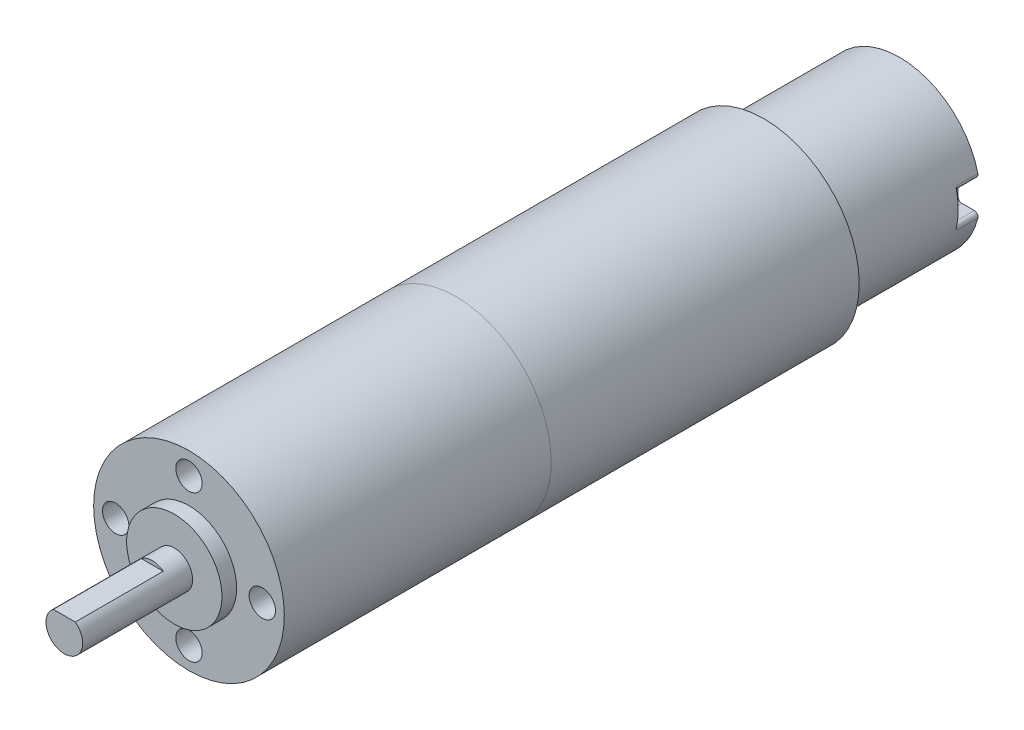
ISO-10303-21;
HEADER;
FILE_DESCRIPTION(('STEP AP214'),'2;1');
FILE_NAME('part.step','',(''),(''),'','','');
FILE_SCHEMA(('AUTOMOTIVE_DESIGN { 1 0 10303 214 1 1 1 1 }'));
ENDSEC;
DATA;
#1=APPLICATION_CONTEXT('core data for automotive mechanical design processes');
#2=APPLICATION_PROTOCOL_DEFINITION('international standard','automotive_design',2000,#1);
#3=PRODUCT_CONTEXT('',#1,'mechanical');
#4=PRODUCT('Part','Part','',(#3));
#5=PRODUCT_RELATED_PRODUCT_CATEGORY('part','',(#4));
#6=PRODUCT_DEFINITION_FORMATION('','',#4);
#7=PRODUCT_DEFINITION_CONTEXT('part definition',#1,'design');
#8=PRODUCT_DEFINITION('design','',#6,#7);
#9=PRODUCT_DEFINITION_SHAPE('','',#8);
#10=(LENGTH_UNIT() NAMED_UNIT(*) SI_UNIT(.MILLI.,.METRE.));
#11=(NAMED_UNIT(*) PLANE_ANGLE_UNIT() SI_UNIT($,.RADIAN.));
#12=(NAMED_UNIT(*) SI_UNIT($,.STERADIAN.) SOLID_ANGLE_UNIT());
#13=UNCERTAINTY_MEASURE_WITH_UNIT(LENGTH_MEASURE(1.E-05),#10,'distance_accuracy_value','');
#14=(GEOMETRIC_REPRESENTATION_CONTEXT(3) GLOBAL_UNCERTAINTY_ASSIGNED_CONTEXT((#13)) GLOBAL_UNIT_ASSIGNED_CONTEXT((#10,
#11,#12)) REPRESENTATION_CONTEXT('',''));
#15=CARTESIAN_POINT('',(0.,0.,0.));
#16=DIRECTION('',(0.,0.,1.));
#17=DIRECTION('',(1.,0.,0.));
#18=AXIS2_PLACEMENT_3D('',#15,#16,#17);
#19=CARTESIAN_POINT('',(0.,0.,-60.5));
#20=DIRECTION('',(0.,0.,1.));
#21=DIRECTION('',(1.,0.,0.));
#22=AXIS2_PLACEMENT_3D('',#19,#20,#21);
#23=CYLINDRICAL_SURFACE('',#22,11.);
#24=CARTESIAN_POINT('',(0.,0.,-56.5));
#25=DIRECTION('',(0.,0.,-1.));
#26=DIRECTION('',(-1.,0.,0.));
#27=AXIS2_PLACEMENT_3D('',#24,#25,#26);
#28=CIRCLE('',#27,11.);
#29=CARTESIAN_POINT('',(7.69839633446142,-7.85714285714285,-56.5));
#30=VERTEX_POINT('',#29);
#31=CARTESIAN_POINT('',(-7.69839633446141,-7.85714285714286,-56.5));
#32=VERTEX_POINT('',#31);
#33=EDGE_CURVE('E311',#30,#32,#28,.T.);
#34=ORIENTED_EDGE('',*,*,#33,.F.);
#35=DIRECTION('',(0.,0.,1.));
#36=VECTOR('',#35,1.);
#37=CARTESIAN_POINT('',(7.69839633446142,-7.85714285714285,-60.5));
#38=LINE('',#37,#36);
#39=CARTESIAN_POINT('',(7.69839633446142,-7.85714285714285,-60.5));
#40=VERTEX_POINT('',#39);
#41=EDGE_CURVE('E214',#30,#40,#38,.F.);
#42=ORIENTED_EDGE('',*,*,#41,.T.);
#43=CARTESIAN_POINT('',(0.,0.,-60.5));
#44=DIRECTION('',(0.,0.,-1.));
#45=DIRECTION('',(-1.,0.,0.));
#46=AXIS2_PLACEMENT_3D('',#43,#44,#45);
#47=CIRCLE('',#46,11.);
#48=CARTESIAN_POINT('',(10.683659933242,-2.61904761904762,-60.5));
#49=VERTEX_POINT('',#48);
#50=EDGE_CURVE('E211',#49,#40,#47,.T.);
#51=ORIENTED_EDGE('',*,*,#50,.F.);
#52=DIRECTION('',(0.,0.,1.));
#53=VECTOR('',#52,1.);
#54=CARTESIAN_POINT('',(10.683659933242,-2.61904761904762,-60.5));
#55=LINE('',#54,#53);
#56=CARTESIAN_POINT('',(10.683659933242,-2.61904761904762,-57.5));
#57=VERTEX_POINT('',#56);
#58=EDGE_CURVE('E307',#49,#57,#55,.T.);
#59=ORIENTED_EDGE('',*,*,#58,.T.);
#60=CARTESIAN_POINT('',(0.,0.,-57.5));
#61=DIRECTION('',(0.,0.,-1.));
#62=DIRECTION('',(-1.,0.,0.));
#63=AXIS2_PLACEMENT_3D('',#60,#61,#62);
#64=CIRCLE('',#63,11.);
#65=CARTESIAN_POINT('',(10.683659933242,2.61904761904762,-57.5));
#66=VERTEX_POINT('',#65);
#67=EDGE_CURVE('E293',#66,#57,#64,.T.);
#68=ORIENTED_EDGE('',*,*,#67,.F.);
#69=DIRECTION('',(0.,0.,1.));
#70=VECTOR('',#69,1.);
#71=CARTESIAN_POINT('',(10.683659933242,2.61904761904762,-60.5));
#72=LINE('',#71,#70);
#73=CARTESIAN_POINT('',(10.683659933242,2.61904761904762,-60.5));
#74=VERTEX_POINT('',#73);
#75=EDGE_CURVE('E320',#66,#74,#72,.F.);
#76=ORIENTED_EDGE('',*,*,#75,.T.);
#77=CARTESIAN_POINT('',(-10.683659933242,2.61904761904762,-60.5));
#78=VERTEX_POINT('',#77);
#79=EDGE_CURVE('E209',#78,#74,#47,.T.);
#80=ORIENTED_EDGE('',*,*,#79,.F.);
#81=DIRECTION('',(0.,0.,1.));
#82=VECTOR('',#81,1.);
#83=CARTESIAN_POINT('',(-10.683659933242,2.61904761904762,-60.5));
#84=LINE('',#83,#82);
#85=CARTESIAN_POINT('',(-10.683659933242,2.61904761904762,-57.5));
#86=VERTEX_POINT('',#85);
#87=EDGE_CURVE('E215',#78,#86,#84,.T.);
#88=ORIENTED_EDGE('',*,*,#87,.T.);
#89=CARTESIAN_POINT('',(0.,0.,-57.5));
#90=DIRECTION('',(0.,0.,1.));
#91=DIRECTION('',(1.,0.,0.));
#92=AXIS2_PLACEMENT_3D('',#89,#90,#91);
#93=CIRCLE('',#92,11.);
#94=CARTESIAN_POINT('',(-10.683659933242,-2.61904761904762,-57.5));
#95=VERTEX_POINT('',#94);
#96=EDGE_CURVE('E350',#86,#95,#93,.T.);
#97=ORIENTED_EDGE('',*,*,#96,.T.);
#98=DIRECTION('',(0.,0.,1.));
#99=VECTOR('',#98,1.);
#100=CARTESIAN_POINT('',(-10.683659933242,-2.61904761904762,-60.5));
#101=LINE('',#100,#99);
#102=CARTESIAN_POINT('',(-10.683659933242,-2.61904761904762,-60.5));
#103=VERTEX_POINT('',#102);
#104=EDGE_CURVE('E207',#95,#103,#101,.F.);
#105=ORIENTED_EDGE('',*,*,#104,.T.);
#106=CARTESIAN_POINT('',(-7.69839633446141,-7.85714285714286,-60.5));
#107=VERTEX_POINT('',#106);
#108=EDGE_CURVE('E190',#107,#103,#47,.T.);
#109=ORIENTED_EDGE('',*,*,#108,.F.);
#110=DIRECTION('',(0.,0.,1.));
#111=VECTOR('',#110,1.);
#112=CARTESIAN_POINT('',(-7.69839633446141,-7.85714285714286,-60.5));
#113=LINE('',#112,#111);
#114=EDGE_CURVE('E204',#107,#32,#113,.T.);
#115=ORIENTED_EDGE('',*,*,#114,.T.);
#116=EDGE_LOOP('',(#34,#42,#51,#59,#68,#76,#80,#88,#97,#105,#109,#115));
#117=FACE_BOUND('',#116,.T.);
#118=CARTESIAN_POINT('',(0.,0.,-42.));
#119=DIRECTION('',(0.,0.,-1.));
#120=DIRECTION('',(-1.,0.,0.));
#121=AXIS2_PLACEMENT_3D('',#118,#119,#120);
#122=CIRCLE('',#121,11.);
#123=CARTESIAN_POINT('',(-11.,0.,-42.));
#124=VERTEX_POINT('',#123);
#125=EDGE_CURVE('E317',#124,#124,#122,.T.);
#126=ORIENTED_EDGE('',*,*,#125,.T.);
#127=EDGE_LOOP('',(#126));
#128=FACE_BOUND('',#127,.T.);
#129=ADVANCED_FACE('F47',(#117,#128),#23,.T.);
#130=CARTESIAN_POINT('',(0.,0.,-60.5));
#131=DIRECTION('',(0.,0.,-1.));
#132=DIRECTION('',(-1.,0.,0.));
#133=AXIS2_PLACEMENT_3D('',#130,#131,#132);
#134=PLANE('',#133);
#135=ORIENTED_EDGE('',*,*,#50,.T.);
#136=CARTESIAN_POINT('',(7.34846922834954,-7.5,-60.5));
#137=DIRECTION('',(0.,0.,-1.));
#138=DIRECTION('',(-1.,0.,0.));
#139=AXIS2_PLACEMENT_3D('',#136,#137,#138);
#140=CIRCLE('',#139,0.5);
#141=CARTESIAN_POINT('',(7.34846922834954,-8.,-60.5));
#142=VERTEX_POINT('',#141);
#143=EDGE_CURVE('E197',#40,#142,#140,.T.);
#144=ORIENTED_EDGE('',*,*,#143,.T.);
#145=DIRECTION('',(-1.,0.,0.));
#146=VECTOR('',#145,1.);
#147=CARTESIAN_POINT('',(0.,-8.,-60.5));
#148=LINE('',#147,#146);
#149=CARTESIAN_POINT('',(-7.34846922834953,-8.,-60.5));
#150=VERTEX_POINT('',#149);
#151=EDGE_CURVE('E192',#142,#150,#148,.T.);
#152=ORIENTED_EDGE('',*,*,#151,.T.);
#153=CARTESIAN_POINT('',(-7.34846922834953,-7.5,-60.5));
#154=DIRECTION('',(0.,0.,-1.));
#155=DIRECTION('',(-1.,0.,0.));
#156=AXIS2_PLACEMENT_3D('',#153,#154,#155);
#157=CIRCLE('',#156,0.5);
#158=EDGE_CURVE('E186',#150,#107,#157,.T.);
#159=ORIENTED_EDGE('',*,*,#158,.T.);
#160=ORIENTED_EDGE('',*,*,#108,.T.);
#161=CARTESIAN_POINT('',(-10.1980390271856,-2.5,-60.5));
#162=DIRECTION('',(0.,0.,-1.));
#163=DIRECTION('',(-1.,0.,0.));
#164=AXIS2_PLACEMENT_3D('',#161,#162,#163);
#165=CIRCLE('',#164,0.5);
#166=CARTESIAN_POINT('',(-10.1980390271856,-2.,-60.5));
#167=VERTEX_POINT('',#166);
#168=EDGE_CURVE('E227',#103,#167,#165,.T.);
#169=ORIENTED_EDGE('',*,*,#168,.T.);
#170=DIRECTION('',(-1.,0.,0.));
#171=VECTOR('',#170,1.);
#172=CARTESIAN_POINT('',(0.,-2.,-60.5));
#173=LINE('',#172,#171);
#174=CARTESIAN_POINT('',(-8.5,-2.,-60.5));
#175=VERTEX_POINT('',#174);
#176=EDGE_CURVE('E358',#175,#167,#173,.T.);
#177=ORIENTED_EDGE('',*,*,#176,.F.);
#178=CARTESIAN_POINT('',(-8.5,-1.5,-60.5));
#179=DIRECTION('',(0.,0.,-1.));
#180=DIRECTION('',(-1.,0.,0.));
#181=AXIS2_PLACEMENT_3D('',#178,#179,#180);
#182=CIRCLE('',#181,0.5);
#183=CARTESIAN_POINT('',(-8.,-1.5,-60.5));
#184=VERTEX_POINT('',#183);
#185=EDGE_CURVE('E282',#175,#184,#182,.F.);
#186=ORIENTED_EDGE('',*,*,#185,.T.);
#187=DIRECTION('',(0.,-1.,0.));
#188=VECTOR('',#187,1.);
#189=CARTESIAN_POINT('',(-8.,0.,-60.5));
#190=LINE('',#189,#188);
#191=CARTESIAN_POINT('',(-8.,1.5,-60.5));
#192=VERTEX_POINT('',#191);
#193=EDGE_CURVE('E362',#192,#184,#190,.T.);
#194=ORIENTED_EDGE('',*,*,#193,.F.);
#195=CARTESIAN_POINT('',(-8.5,1.5,-60.5));
#196=DIRECTION('',(0.,0.,-1.));
#197=DIRECTION('',(-1.,0.,0.));
#198=AXIS2_PLACEMENT_3D('',#195,#196,#197);
#199=CIRCLE('',#198,0.5);
#200=CARTESIAN_POINT('',(-8.5,2.,-60.5));
#201=VERTEX_POINT('',#200);
#202=EDGE_CURVE('E280',#192,#201,#199,.F.);
#203=ORIENTED_EDGE('',*,*,#202,.T.);
#204=DIRECTION('',(-1.,0.,0.));
#205=VECTOR('',#204,1.);
#206=CARTESIAN_POINT('',(0.,2.,-60.5));
#207=LINE('',#206,#205);
#208=CARTESIAN_POINT('',(-10.1980390271856,2.,-60.5));
#209=VERTEX_POINT('',#208);
#210=EDGE_CURVE('E336',#201,#209,#207,.T.);
#211=ORIENTED_EDGE('',*,*,#210,.T.);
#212=CARTESIAN_POINT('',(-10.1980390271856,2.5,-60.5));
#213=DIRECTION('',(0.,0.,-1.));
#214=DIRECTION('',(-1.,0.,0.));
#215=AXIS2_PLACEMENT_3D('',#212,#213,#214);
#216=CIRCLE('',#215,0.5);
#217=EDGE_CURVE('E198',#209,#78,#216,.T.);
#218=ORIENTED_EDGE('',*,*,#217,.T.);
#219=ORIENTED_EDGE('',*,*,#79,.T.);
#220=CARTESIAN_POINT('',(10.1980390271856,2.5,-60.5));
#221=DIRECTION('',(0.,0.,-1.));
#222=DIRECTION('',(-1.,0.,0.));
#223=AXIS2_PLACEMENT_3D('',#220,#221,#222);
#224=CIRCLE('',#223,0.5);
#225=CARTESIAN_POINT('',(10.1980390271856,2.,-60.5));
#226=VERTEX_POINT('',#225);
#227=EDGE_CURVE('E218',#74,#226,#224,.T.);
#228=ORIENTED_EDGE('',*,*,#227,.T.);
#229=DIRECTION('',(1.,0.,0.));
#230=VECTOR('',#229,1.);
#231=CARTESIAN_POINT('',(0.,2.,-60.5));
#232=LINE('',#231,#230);
#233=CARTESIAN_POINT('',(8.5,2.,-60.5));
#234=VERTEX_POINT('',#233);
#235=EDGE_CURVE('E304',#234,#226,#232,.T.);
#236=ORIENTED_EDGE('',*,*,#235,.F.);
#237=CARTESIAN_POINT('',(8.5,1.5,-60.5));
#238=DIRECTION('',(0.,0.,-1.));
#239=DIRECTION('',(-1.,0.,0.));
#240=AXIS2_PLACEMENT_3D('',#237,#238,#239);
#241=CIRCLE('',#240,0.5);
#242=CARTESIAN_POINT('',(8.,1.5,-60.5));
#243=VERTEX_POINT('',#242);
#244=EDGE_CURVE('E286',#234,#243,#241,.F.);
#245=ORIENTED_EDGE('',*,*,#244,.T.);
#246=DIRECTION('',(0.,-1.,0.));
#247=VECTOR('',#246,1.);
#248=CARTESIAN_POINT('',(8.,0.,-60.5));
#249=LINE('',#248,#247);
#250=CARTESIAN_POINT('',(8.,-1.5,-60.5));
#251=VERTEX_POINT('',#250);
#252=EDGE_CURVE('E371',#243,#251,#249,.T.);
#253=ORIENTED_EDGE('',*,*,#252,.T.);
#254=CARTESIAN_POINT('',(8.5,-1.5,-60.5));
#255=DIRECTION('',(0.,0.,-1.));
#256=DIRECTION('',(-1.,0.,0.));
#257=AXIS2_PLACEMENT_3D('',#254,#255,#256);
#258=CIRCLE('',#257,0.5);
#259=CARTESIAN_POINT('',(8.5,-2.,-60.5));
#260=VERTEX_POINT('',#259);
#261=EDGE_CURVE('E284',#251,#260,#258,.F.);
#262=ORIENTED_EDGE('',*,*,#261,.T.);
#263=DIRECTION('',(1.,0.,0.));
#264=VECTOR('',#263,1.);
#265=CARTESIAN_POINT('',(0.,-2.,-60.5));
#266=LINE('',#265,#264);
#267=CARTESIAN_POINT('',(10.1980390271856,-2.,-60.5));
#268=VERTEX_POINT('',#267);
#269=EDGE_CURVE('E309',#260,#268,#266,.T.);
#270=ORIENTED_EDGE('',*,*,#269,.T.);
#271=CARTESIAN_POINT('',(10.1980390271856,-2.5,-60.5));
#272=DIRECTION('',(0.,0.,-1.));
#273=DIRECTION('',(-1.,0.,0.));
#274=AXIS2_PLACEMENT_3D('',#271,#272,#273);
#275=CIRCLE('',#274,0.5);
#276=EDGE_CURVE('E225',#268,#49,#275,.T.);
#277=ORIENTED_EDGE('',*,*,#276,.T.);
#278=EDGE_LOOP('',(#135,#144,#152,#159,#160,#169,#177,#186,#194,#203,#211,#218,#219,#228,#236,
#245,#253,#262,#270,#277));
#279=FACE_BOUND('',#278,.T.);
#280=ADVANCED_FACE('F189',(#279),#134,.T.);
#281=CARTESIAN_POINT('',(0.,0.,-42.));
#282=DIRECTION('',(0.,0.,1.));
#283=DIRECTION('',(1.,0.,0.));
#284=AXIS2_PLACEMENT_3D('',#281,#282,#283);
#285=CYLINDRICAL_SURFACE('',#284,13.);
#286=CARTESIAN_POINT('',(0.,0.,-42.));
#287=DIRECTION('',(0.,0.,-1.));
#288=DIRECTION('',(-1.,0.,0.));
#289=AXIS2_PLACEMENT_3D('',#286,#287,#288);
#290=CIRCLE('',#289,13.);
#291=CARTESIAN_POINT('',(-13.,0.,-42.));
#292=VERTEX_POINT('',#291);
#293=EDGE_CURVE('E321',#292,#292,#290,.T.);
#294=ORIENTED_EDGE('',*,*,#293,.F.);
#295=EDGE_LOOP('',(#294));
#296=FACE_BOUND('',#295,.T.);
#297=CARTESIAN_POINT('',(0.,0.,0.));
#298=DIRECTION('',(0.,0.,-1.));
#299=DIRECTION('',(-1.,0.,0.));
#300=AXIS2_PLACEMENT_3D('',#297,#298,#299);
#301=CIRCLE('',#300,13.);
#302=CARTESIAN_POINT('',(-13.,0.,0.));
#303=VERTEX_POINT('',#302);
#304=EDGE_CURVE('E208',#303,#303,#301,.T.);
#305=ORIENTED_EDGE('',*,*,#304,.T.);
#306=EDGE_LOOP('',(#305));
#307=FACE_BOUND('',#306,.T.);
#308=ADVANCED_FACE('F400',(#296,#307),#285,.T.);
#309=CARTESIAN_POINT('',(0.,0.,-42.));
#310=DIRECTION('',(0.,0.,-1.));
#311=DIRECTION('',(-1.,0.,0.));
#312=AXIS2_PLACEMENT_3D('',#309,#310,#311);
#313=PLANE('',#312);
#314=ORIENTED_EDGE('',*,*,#125,.F.);
#315=EDGE_LOOP('',(#314));
#316=FACE_BOUND('',#315,.T.);
#317=ORIENTED_EDGE('',*,*,#293,.T.);
#318=EDGE_LOOP('',(#317));
#319=FACE_BOUND('',#318,.T.);
#320=ADVANCED_FACE('F404',(#316,#319),#313,.T.);
#321=CARTESIAN_POINT('',(0.,0.,0.));
#322=DIRECTION('',(0.,0.,-1.));
#323=DIRECTION('',(-1.,0.,0.));
#324=AXIS2_PLACEMENT_3D('',#321,#322,#323);
#325=PLANE('',#324);
#326=ORIENTED_EDGE('',*,*,#304,.F.);
#327=EDGE_LOOP('',(#326));
#328=FACE_BOUND('',#327,.T.);
#329=ADVANCED_FACE('F407',(#328),#325,.F.);
#330=CARTESIAN_POINT('',(0.,-8.,-56.5));
#331=DIRECTION('',(0.,-1.,0.));
#332=DIRECTION('',(1.,0.,0.));
#333=AXIS2_PLACEMENT_3D('',#330,#331,#332);
#334=PLANE('',#333);
#335=ORIENTED_EDGE('',*,*,#151,.F.);
#336=DIRECTION('',(0.,0.,-1.));
#337=VECTOR('',#336,1.);
#338=CARTESIAN_POINT('',(7.34846922834954,-8.,-56.5));
#339=LINE('',#338,#337);
#340=CARTESIAN_POINT('',(7.34846922834954,-8.,-56.5));
#341=VERTEX_POINT('',#340);
#342=EDGE_CURVE('E233',#142,#341,#339,.F.);
#343=ORIENTED_EDGE('',*,*,#342,.T.);
#344=DIRECTION('',(-1.,0.,0.));
#345=VECTOR('',#344,1.);
#346=CARTESIAN_POINT('',(0.,-8.,-56.5));
#347=LINE('',#346,#345);
#348=CARTESIAN_POINT('',(-7.34846922834953,-8.,-56.5));
#349=VERTEX_POINT('',#348);
#350=EDGE_CURVE('E313',#341,#349,#347,.T.);
#351=ORIENTED_EDGE('',*,*,#350,.T.);
#352=DIRECTION('',(0.,0.,-1.));
#353=VECTOR('',#352,1.);
#354=CARTESIAN_POINT('',(-7.34846922834953,-8.,-60.5));
#355=LINE('',#354,#353);
#356=EDGE_CURVE('E231',#349,#150,#355,.T.);
#357=ORIENTED_EDGE('',*,*,#356,.T.);
#358=EDGE_LOOP('',(#335,#343,#351,#357));
#359=FACE_BOUND('',#358,.T.);
#360=ADVANCED_FACE('F378',(#359),#334,.T.);
#361=CARTESIAN_POINT('',(0.,0.,-56.5));
#362=DIRECTION('',(0.,0.,-1.));
#363=DIRECTION('',(-1.,0.,0.));
#364=AXIS2_PLACEMENT_3D('',#361,#362,#363);
#365=PLANE('',#364);
#366=ORIENTED_EDGE('',*,*,#350,.F.);
#367=CARTESIAN_POINT('',(7.34846922834954,-7.5,-56.5));
#368=DIRECTION('',(0.,0.,-1.));
#369=DIRECTION('',(-1.,0.,0.));
#370=AXIS2_PLACEMENT_3D('',#367,#368,#369);
#371=CIRCLE('',#370,0.5);
#372=EDGE_CURVE('E271',#341,#30,#371,.F.);
#373=ORIENTED_EDGE('',*,*,#372,.T.);
#374=ORIENTED_EDGE('',*,*,#33,.T.);
#375=CARTESIAN_POINT('',(-7.34846922834953,-7.5,-56.5));
#376=DIRECTION('',(0.,0.,-1.));
#377=DIRECTION('',(-1.,0.,0.));
#378=AXIS2_PLACEMENT_3D('',#375,#376,#377);
#379=CIRCLE('',#378,0.5);
#380=EDGE_CURVE('E213',#32,#349,#379,.F.);
#381=ORIENTED_EDGE('',*,*,#380,.T.);
#382=EDGE_LOOP('',(#366,#373,#374,#381));
#383=FACE_BOUND('',#382,.T.);
#384=ADVANCED_FACE('F382',(#383),#365,.T.);
#385=CARTESIAN_POINT('',(0.,-2.,-57.5));
#386=DIRECTION('',(0.,1.,0.));
#387=DIRECTION('',(0.,0.,1.));
#388=AXIS2_PLACEMENT_3D('',#385,#386,#387);
#389=PLANE('',#388);
#390=ORIENTED_EDGE('',*,*,#269,.F.);
#391=DIRECTION('',(0.,0.,-1.));
#392=VECTOR('',#391,1.);
#393=CARTESIAN_POINT('',(8.5,-2.,-57.5));
#394=LINE('',#393,#392);
#395=CARTESIAN_POINT('',(8.5,-2.,-57.5));
#396=VERTEX_POINT('',#395);
#397=EDGE_CURVE('E262',#260,#396,#394,.F.);
#398=ORIENTED_EDGE('',*,*,#397,.T.);
#399=DIRECTION('',(1.,0.,0.));
#400=VECTOR('',#399,1.);
#401=CARTESIAN_POINT('',(0.,-2.,-57.5));
#402=LINE('',#401,#400);
#403=CARTESIAN_POINT('',(10.1980390271856,-2.,-57.5));
#404=VERTEX_POINT('',#403);
#405=EDGE_CURVE('E291',#396,#404,#402,.T.);
#406=ORIENTED_EDGE('',*,*,#405,.T.);
#407=DIRECTION('',(0.,0.,-1.));
#408=VECTOR('',#407,1.);
#409=CARTESIAN_POINT('',(10.1980390271856,-2.,-60.5));
#410=LINE('',#409,#408);
#411=EDGE_CURVE('E259',#404,#268,#410,.T.);
#412=ORIENTED_EDGE('',*,*,#411,.T.);
#413=EDGE_LOOP('',(#390,#398,#406,#412));
#414=FACE_BOUND('',#413,.T.);
#415=ADVANCED_FACE('F300',(#414),#389,.T.);
#416=CARTESIAN_POINT('',(0.,2.,-57.5));
#417=DIRECTION('',(0.,1.,0.));
#418=DIRECTION('',(0.,0.,1.));
#419=AXIS2_PLACEMENT_3D('',#416,#417,#418);
#420=PLANE('',#419);
#421=DIRECTION('',(1.,0.,0.));
#422=VECTOR('',#421,1.);
#423=CARTESIAN_POINT('',(0.,2.,-57.5));
#424=LINE('',#423,#422);
#425=CARTESIAN_POINT('',(8.5,2.,-57.5));
#426=VERTEX_POINT('',#425);
#427=CARTESIAN_POINT('',(10.1980390271856,2.,-57.5));
#428=VERTEX_POINT('',#427);
#429=EDGE_CURVE('E367',#426,#428,#424,.T.);
#430=ORIENTED_EDGE('',*,*,#429,.F.);
#431=DIRECTION('',(0.,0.,-1.));
#432=VECTOR('',#431,1.);
#433=CARTESIAN_POINT('',(8.5,2.,-57.5));
#434=LINE('',#433,#432);
#435=EDGE_CURVE('E268',#426,#234,#434,.T.);
#436=ORIENTED_EDGE('',*,*,#435,.T.);
#437=ORIENTED_EDGE('',*,*,#235,.T.);
#438=DIRECTION('',(0.,0.,1.));
#439=VECTOR('',#438,1.);
#440=CARTESIAN_POINT('',(10.1980390271856,2.,-57.5));
#441=LINE('',#440,#439);
#442=EDGE_CURVE('E62',#226,#428,#441,.T.);
#443=ORIENTED_EDGE('',*,*,#442,.T.);
#444=EDGE_LOOP('',(#430,#436,#437,#443));
#445=FACE_BOUND('',#444,.T.);
#446=ADVANCED_FACE('F448',(#445),#420,.F.);
#447=CARTESIAN_POINT('',(8.,0.,-57.5));
#448=DIRECTION('',(1.,0.,0.));
#449=DIRECTION('',(0.,0.,-1.));
#450=AXIS2_PLACEMENT_3D('',#447,#448,#449);
#451=PLANE('',#450);
#452=DIRECTION('',(0.,-1.,0.));
#453=VECTOR('',#452,1.);
#454=CARTESIAN_POINT('',(8.,0.,-57.5));
#455=LINE('',#454,#453);
#456=CARTESIAN_POINT('',(8.,1.5,-57.5));
#457=VERTEX_POINT('',#456);
#458=CARTESIAN_POINT('',(8.,-1.5,-57.5));
#459=VERTEX_POINT('',#458);
#460=EDGE_CURVE('E303',#457,#459,#455,.T.);
#461=ORIENTED_EDGE('',*,*,#460,.T.);
#462=DIRECTION('',(0.,0.,-1.));
#463=VECTOR('',#462,1.);
#464=CARTESIAN_POINT('',(8.,-1.5,-60.5));
#465=LINE('',#464,#463);
#466=EDGE_CURVE('E256',#459,#251,#465,.T.);
#467=ORIENTED_EDGE('',*,*,#466,.T.);
#468=ORIENTED_EDGE('',*,*,#252,.F.);
#469=DIRECTION('',(0.,0.,-1.));
#470=VECTOR('',#469,1.);
#471=CARTESIAN_POINT('',(8.,1.5,-57.5));
#472=LINE('',#471,#470);
#473=EDGE_CURVE('E254',#243,#457,#472,.F.);
#474=ORIENTED_EDGE('',*,*,#473,.T.);
#475=EDGE_LOOP('',(#461,#467,#468,#474));
#476=FACE_BOUND('',#475,.T.);
#477=ADVANCED_FACE('F456',(#476),#451,.T.);
#478=CARTESIAN_POINT('',(0.,0.,-57.5));
#479=DIRECTION('',(0.,0.,-1.));
#480=DIRECTION('',(-1.,0.,0.));
#481=AXIS2_PLACEMENT_3D('',#478,#479,#480);
#482=PLANE('',#481);
#483=ORIENTED_EDGE('',*,*,#405,.F.);
#484=CARTESIAN_POINT('',(8.5,-1.5,-57.5));
#485=DIRECTION('',(0.,0.,-1.));
#486=DIRECTION('',(-1.,0.,0.));
#487=AXIS2_PLACEMENT_3D('',#484,#485,#486);
#488=CIRCLE('',#487,0.5);
#489=EDGE_CURVE('E265',#396,#459,#488,.T.);
#490=ORIENTED_EDGE('',*,*,#489,.T.);
#491=ORIENTED_EDGE('',*,*,#460,.F.);
#492=CARTESIAN_POINT('',(8.5,1.5,-57.5));
#493=DIRECTION('',(0.,0.,-1.));
#494=DIRECTION('',(-1.,0.,0.));
#495=AXIS2_PLACEMENT_3D('',#492,#493,#494);
#496=CIRCLE('',#495,0.5);
#497=EDGE_CURVE('E69',#457,#426,#496,.T.);
#498=ORIENTED_EDGE('',*,*,#497,.T.);
#499=ORIENTED_EDGE('',*,*,#429,.T.);
#500=CARTESIAN_POINT('',(10.1980390271856,2.5,-57.5));
#501=DIRECTION('',(0.,0.,-1.));
#502=DIRECTION('',(-1.,0.,0.));
#503=AXIS2_PLACEMENT_3D('',#500,#501,#502);
#504=CIRCLE('',#503,0.5);
#505=EDGE_CURVE('E12',#428,#66,#504,.F.);
#506=ORIENTED_EDGE('',*,*,#505,.T.);
#507=ORIENTED_EDGE('',*,*,#67,.T.);
#508=CARTESIAN_POINT('',(10.1980390271856,-2.5,-57.5));
#509=DIRECTION('',(0.,0.,-1.));
#510=DIRECTION('',(-1.,0.,0.));
#511=AXIS2_PLACEMENT_3D('',#508,#509,#510);
#512=CIRCLE('',#511,0.5);
#513=EDGE_CURVE('E55',#57,#404,#512,.F.);
#514=ORIENTED_EDGE('',*,*,#513,.T.);
#515=EDGE_LOOP('',(#483,#490,#491,#498,#499,#506,#507,#514));
#516=FACE_BOUND('',#515,.T.);
#517=ADVANCED_FACE('F290',(#516),#482,.T.);
#518=CARTESIAN_POINT('',(0.,-2.,-57.5));
#519=DIRECTION('',(0.,-1.,0.));
#520=DIRECTION('',(0.,0.,-1.));
#521=AXIS2_PLACEMENT_3D('',#518,#519,#520);
#522=PLANE('',#521);
#523=ORIENTED_EDGE('',*,*,#176,.T.);
#524=DIRECTION('',(0.,0.,1.));
#525=VECTOR('',#524,1.);
#526=CARTESIAN_POINT('',(-10.1980390271856,-2.,-57.5));
#527=LINE('',#526,#525);
#528=CARTESIAN_POINT('',(-10.1980390271856,-2.,-57.5));
#529=VERTEX_POINT('',#528);
#530=EDGE_CURVE('E243',#167,#529,#527,.T.);
#531=ORIENTED_EDGE('',*,*,#530,.T.);
#532=DIRECTION('',(-1.,0.,0.));
#533=VECTOR('',#532,1.);
#534=CARTESIAN_POINT('',(0.,-2.,-57.5));
#535=LINE('',#534,#533);
#536=CARTESIAN_POINT('',(-8.5,-2.,-57.5));
#537=VERTEX_POINT('',#536);
#538=EDGE_CURVE('E354',#537,#529,#535,.T.);
#539=ORIENTED_EDGE('',*,*,#538,.F.);
#540=DIRECTION('',(0.,0.,-1.));
#541=VECTOR('',#540,1.);
#542=CARTESIAN_POINT('',(-8.5,-2.,-60.5));
#543=LINE('',#542,#541);
#544=EDGE_CURVE('E240',#537,#175,#543,.T.);
#545=ORIENTED_EDGE('',*,*,#544,.T.);
#546=EDGE_LOOP('',(#523,#531,#539,#545));
#547=FACE_BOUND('',#546,.T.);
#548=ADVANCED_FACE('F472',(#547),#522,.F.);
#549=CARTESIAN_POINT('',(-8.,0.,-57.5));
#550=DIRECTION('',(1.,0.,0.));
#551=DIRECTION('',(0.,0.,-1.));
#552=AXIS2_PLACEMENT_3D('',#549,#550,#551);
#553=PLANE('',#552);
#554=DIRECTION('',(0.,-1.,0.));
#555=VECTOR('',#554,1.);
#556=CARTESIAN_POINT('',(-8.,0.,-57.5));
#557=LINE('',#556,#555);
#558=CARTESIAN_POINT('',(-8.,1.5,-57.5));
#559=VERTEX_POINT('',#558);
#560=CARTESIAN_POINT('',(-8.,-1.5,-57.5));
#561=VERTEX_POINT('',#560);
#562=EDGE_CURVE('E349',#559,#561,#557,.T.);
#563=ORIENTED_EDGE('',*,*,#562,.F.);
#564=DIRECTION('',(0.,0.,-1.));
#565=VECTOR('',#564,1.);
#566=CARTESIAN_POINT('',(-8.,1.5,-57.5));
#567=LINE('',#566,#565);
#568=EDGE_CURVE('E247',#559,#192,#567,.T.);
#569=ORIENTED_EDGE('',*,*,#568,.T.);
#570=ORIENTED_EDGE('',*,*,#193,.T.);
#571=DIRECTION('',(0.,0.,-1.));
#572=VECTOR('',#571,1.);
#573=CARTESIAN_POINT('',(-8.,-1.5,-57.5));
#574=LINE('',#573,#572);
#575=EDGE_CURVE('E245',#184,#561,#574,.F.);
#576=ORIENTED_EDGE('',*,*,#575,.T.);
#577=EDGE_LOOP('',(#563,#569,#570,#576));
#578=FACE_BOUND('',#577,.T.);
#579=ADVANCED_FACE('F479',(#578),#553,.F.);
#580=CARTESIAN_POINT('',(0.,2.,-57.5));
#581=DIRECTION('',(0.,-1.,0.));
#582=DIRECTION('',(0.,0.,-1.));
#583=AXIS2_PLACEMENT_3D('',#580,#581,#582);
#584=PLANE('',#583);
#585=DIRECTION('',(-1.,0.,0.));
#586=VECTOR('',#585,1.);
#587=CARTESIAN_POINT('',(0.,2.,-57.5));
#588=LINE('',#587,#586);
#589=CARTESIAN_POINT('',(-8.5,2.,-57.5));
#590=VERTEX_POINT('',#589);
#591=CARTESIAN_POINT('',(-10.1980390271856,2.,-57.5));
#592=VERTEX_POINT('',#591);
#593=EDGE_CURVE('E346',#590,#592,#588,.T.);
#594=ORIENTED_EDGE('',*,*,#593,.T.);
#595=DIRECTION('',(0.,0.,-1.));
#596=VECTOR('',#595,1.);
#597=CARTESIAN_POINT('',(-10.1980390271856,2.,-60.5));
#598=LINE('',#597,#596);
#599=EDGE_CURVE('E237',#592,#209,#598,.T.);
#600=ORIENTED_EDGE('',*,*,#599,.T.);
#601=ORIENTED_EDGE('',*,*,#210,.F.);
#602=DIRECTION('',(0.,0.,-1.));
#603=VECTOR('',#602,1.);
#604=CARTESIAN_POINT('',(-8.5,2.,-57.5));
#605=LINE('',#604,#603);
#606=EDGE_CURVE('E235',#201,#590,#605,.F.);
#607=ORIENTED_EDGE('',*,*,#606,.T.);
#608=EDGE_LOOP('',(#594,#600,#601,#607));
#609=FACE_BOUND('',#608,.T.);
#610=ADVANCED_FACE('F343',(#609),#584,.T.);
#611=CARTESIAN_POINT('',(0.,0.,-57.5));
#612=DIRECTION('',(0.,0.,-1.));
#613=DIRECTION('',(1.,0.,0.));
#614=AXIS2_PLACEMENT_3D('',#611,#612,#613);
#615=PLANE('',#614);
#616=ORIENTED_EDGE('',*,*,#593,.F.);
#617=CARTESIAN_POINT('',(-8.5,1.5,-57.5));
#618=DIRECTION('',(0.,0.,-1.));
#619=DIRECTION('',(-1.,0.,0.));
#620=AXIS2_PLACEMENT_3D('',#617,#618,#619);
#621=CIRCLE('',#620,0.5);
#622=EDGE_CURVE('E252',#590,#559,#621,.T.);
#623=ORIENTED_EDGE('',*,*,#622,.T.);
#624=ORIENTED_EDGE('',*,*,#562,.T.);
#625=CARTESIAN_POINT('',(-8.5,-1.5,-57.5));
#626=DIRECTION('',(0.,0.,-1.));
#627=DIRECTION('',(-1.,0.,0.));
#628=AXIS2_PLACEMENT_3D('',#625,#626,#627);
#629=CIRCLE('',#628,0.5);
#630=EDGE_CURVE('E250',#561,#537,#629,.T.);
#631=ORIENTED_EDGE('',*,*,#630,.T.);
#632=ORIENTED_EDGE('',*,*,#538,.T.);
#633=CARTESIAN_POINT('',(-10.1980390271856,-2.5,-57.5));
#634=DIRECTION('',(0.,0.,-1.));
#635=DIRECTION('',(-1.,0.,0.));
#636=AXIS2_PLACEMENT_3D('',#633,#634,#635);
#637=CIRCLE('',#636,0.5);
#638=EDGE_CURVE('E277',#529,#95,#637,.F.);
#639=ORIENTED_EDGE('',*,*,#638,.T.);
#640=ORIENTED_EDGE('',*,*,#96,.F.);
#641=CARTESIAN_POINT('',(-10.1980390271856,2.5,-57.5));
#642=DIRECTION('',(0.,0.,-1.));
#643=DIRECTION('',(-1.,0.,0.));
#644=AXIS2_PLACEMENT_3D('',#641,#642,#643);
#645=CIRCLE('',#644,0.5);
#646=EDGE_CURVE('E275',#86,#592,#645,.F.);
#647=ORIENTED_EDGE('',*,*,#646,.T.);
#648=EDGE_LOOP('',(#616,#623,#624,#631,#632,#639,#640,#647));
#649=FACE_BOUND('',#648,.T.);
#650=ADVANCED_FACE('F386',(#649),#615,.T.);
#651=CARTESIAN_POINT('',(7.34846922834954,-7.5,-60.5));
#652=DIRECTION('',(0.,0.,1.));
#653=DIRECTION('',(1.,0.,0.));
#654=AXIS2_PLACEMENT_3D('',#651,#652,#653);
#655=CYLINDRICAL_SURFACE('',#654,0.5);
#656=ORIENTED_EDGE('',*,*,#372,.F.);
#657=ORIENTED_EDGE('',*,*,#342,.F.);
#658=ORIENTED_EDGE('',*,*,#143,.F.);
#659=ORIENTED_EDGE('',*,*,#41,.F.);
#660=EDGE_LOOP('',(#656,#657,#658,#659));
#661=FACE_BOUND('',#660,.T.);
#662=ADVANCED_FACE('F384',(#661),#655,.T.);
#663=CARTESIAN_POINT('',(-7.34846922834953,-7.5,-60.5));
#664=DIRECTION('',(0.,0.,1.));
#665=DIRECTION('',(1.,0.,0.));
#666=AXIS2_PLACEMENT_3D('',#663,#664,#665);
#667=CYLINDRICAL_SURFACE('',#666,0.5);
#668=ORIENTED_EDGE('',*,*,#380,.F.);
#669=ORIENTED_EDGE('',*,*,#114,.F.);
#670=ORIENTED_EDGE('',*,*,#158,.F.);
#671=ORIENTED_EDGE('',*,*,#356,.F.);
#672=EDGE_LOOP('',(#668,#669,#670,#671));
#673=FACE_BOUND('',#672,.T.);
#674=ADVANCED_FACE('F212',(#673),#667,.T.);
#675=CARTESIAN_POINT('',(-10.1980390271856,2.5,-60.5));
#676=DIRECTION('',(0.,0.,1.));
#677=DIRECTION('',(1.,0.,0.));
#678=AXIS2_PLACEMENT_3D('',#675,#676,#677);
#679=CYLINDRICAL_SURFACE('',#678,0.5);
#680=ORIENTED_EDGE('',*,*,#646,.F.);
#681=ORIENTED_EDGE('',*,*,#87,.F.);
#682=ORIENTED_EDGE('',*,*,#217,.F.);
#683=ORIENTED_EDGE('',*,*,#599,.F.);
#684=EDGE_LOOP('',(#680,#681,#682,#683));
#685=FACE_BOUND('',#684,.T.);
#686=ADVANCED_FACE('F340',(#685),#679,.T.);
#687=CARTESIAN_POINT('',(-10.1980390271856,-2.5,-60.5));
#688=DIRECTION('',(0.,0.,1.));
#689=DIRECTION('',(1.,0.,0.));
#690=AXIS2_PLACEMENT_3D('',#687,#688,#689);
#691=CYLINDRICAL_SURFACE('',#690,0.5);
#692=ORIENTED_EDGE('',*,*,#638,.F.);
#693=ORIENTED_EDGE('',*,*,#530,.F.);
#694=ORIENTED_EDGE('',*,*,#168,.F.);
#695=ORIENTED_EDGE('',*,*,#104,.F.);
#696=EDGE_LOOP('',(#692,#693,#694,#695));
#697=FACE_BOUND('',#696,.T.);
#698=ADVANCED_FACE('F509',(#697),#691,.T.);
#699=CARTESIAN_POINT('',(-8.5,1.5,-57.5));
#700=DIRECTION('',(0.,0.,-1.));
#701=DIRECTION('',(-1.,0.,0.));
#702=AXIS2_PLACEMENT_3D('',#699,#700,#701);
#703=CYLINDRICAL_SURFACE('',#702,0.5);
#704=ORIENTED_EDGE('',*,*,#622,.F.);
#705=ORIENTED_EDGE('',*,*,#606,.F.);
#706=ORIENTED_EDGE('',*,*,#202,.F.);
#707=ORIENTED_EDGE('',*,*,#568,.F.);
#708=EDGE_LOOP('',(#704,#705,#706,#707));
#709=FACE_BOUND('',#708,.T.);
#710=ADVANCED_FACE('F513',(#709),#703,.F.);
#711=CARTESIAN_POINT('',(-8.5,-1.5,-57.5));
#712=DIRECTION('',(0.,0.,1.));
#713=DIRECTION('',(1.,0.,0.));
#714=AXIS2_PLACEMENT_3D('',#711,#712,#713);
#715=CYLINDRICAL_SURFACE('',#714,0.5);
#716=ORIENTED_EDGE('',*,*,#630,.F.);
#717=ORIENTED_EDGE('',*,*,#575,.F.);
#718=ORIENTED_EDGE('',*,*,#185,.F.);
#719=ORIENTED_EDGE('',*,*,#544,.F.);
#720=EDGE_LOOP('',(#716,#717,#718,#719));
#721=FACE_BOUND('',#720,.T.);
#722=ADVANCED_FACE('F526',(#721),#715,.F.);
#723=CARTESIAN_POINT('',(8.5,-1.5,-57.5));
#724=DIRECTION('',(0.,0.,1.));
#725=DIRECTION('',(1.,0.,0.));
#726=AXIS2_PLACEMENT_3D('',#723,#724,#725);
#727=CYLINDRICAL_SURFACE('',#726,0.5);
#728=ORIENTED_EDGE('',*,*,#489,.F.);
#729=ORIENTED_EDGE('',*,*,#397,.F.);
#730=ORIENTED_EDGE('',*,*,#261,.F.);
#731=ORIENTED_EDGE('',*,*,#466,.F.);
#732=EDGE_LOOP('',(#728,#729,#730,#731));
#733=FACE_BOUND('',#732,.T.);
#734=ADVANCED_FACE('F532',(#733),#727,.F.);
#735=CARTESIAN_POINT('',(8.5,1.5,-57.5));
#736=DIRECTION('',(0.,0.,-1.));
#737=DIRECTION('',(-1.,0.,0.));
#738=AXIS2_PLACEMENT_3D('',#735,#736,#737);
#739=CYLINDRICAL_SURFACE('',#738,0.5);
#740=ORIENTED_EDGE('',*,*,#497,.F.);
#741=ORIENTED_EDGE('',*,*,#473,.F.);
#742=ORIENTED_EDGE('',*,*,#244,.F.);
#743=ORIENTED_EDGE('',*,*,#435,.F.);
#744=EDGE_LOOP('',(#740,#741,#742,#743));
#745=FACE_BOUND('',#744,.T.);
#746=ADVANCED_FACE('F539',(#745),#739,.F.);
#747=CARTESIAN_POINT('',(10.1980390271856,-2.5,-60.5));
#748=DIRECTION('',(0.,0.,1.));
#749=DIRECTION('',(1.,0.,0.));
#750=AXIS2_PLACEMENT_3D('',#747,#748,#749);
#751=CYLINDRICAL_SURFACE('',#750,0.5);
#752=ORIENTED_EDGE('',*,*,#513,.F.);
#753=ORIENTED_EDGE('',*,*,#58,.F.);
#754=ORIENTED_EDGE('',*,*,#276,.F.);
#755=ORIENTED_EDGE('',*,*,#411,.F.);
#756=EDGE_LOOP('',(#752,#753,#754,#755));
#757=FACE_BOUND('',#756,.T.);
#758=ADVANCED_FACE('F306',(#757),#751,.T.);
#759=CARTESIAN_POINT('',(10.1980390271856,2.5,-60.5));
#760=DIRECTION('',(0.,0.,1.));
#761=DIRECTION('',(1.,0.,0.));
#762=AXIS2_PLACEMENT_3D('',#759,#760,#761);
#763=CYLINDRICAL_SURFACE('',#762,0.5);
#764=ORIENTED_EDGE('',*,*,#505,.F.);
#765=ORIENTED_EDGE('',*,*,#442,.F.);
#766=ORIENTED_EDGE('',*,*,#227,.F.);
#767=ORIENTED_EDGE('',*,*,#75,.F.);
#768=EDGE_LOOP('',(#764,#765,#766,#767));
#769=FACE_BOUND('',#768,.T.);
#770=ADVANCED_FACE('F49',(#769),#763,.T.);
#771=CLOSED_SHELL('',(#129,#280,#308,#320,#329,#360,#384,#415,#446,#477,#517,#548,#579,#610,
#650,#662,#674,#686,#698,#710,#722,#734,#746,#758,#770));
#772=MANIFOLD_SOLID_BREP('B2',#771);
#773=CARTESIAN_POINT('',(0.,0.,39.4));
#774=DIRECTION('',(0.,0.,-1.));
#775=DIRECTION('',(-1.,0.,0.));
#776=AXIS2_PLACEMENT_3D('',#773,#774,#775);
#777=CYLINDRICAL_SURFACE('',#776,2.49680534345229);
#778=CARTESIAN_POINT('',(0.,0.,39.4));
#779=DIRECTION('',(0.,0.,1.));
#780=DIRECTION('',(1.,0.,0.));
#781=AXIS2_PLACEMENT_3D('',#778,#779,#780);
#782=CIRCLE('',#781,2.49680534345229);
#783=CARTESIAN_POINT('',(2.49680534345229,0.,39.4));
#784=VERTEX_POINT('',#783);
#785=EDGE_CURVE('E46',#784,#784,#782,.T.);
#786=ORIENTED_EDGE('',*,*,#785,.F.);
#787=EDGE_LOOP('',(#786));
#788=FACE_BOUND('',#787,.T.);
#789=CARTESIAN_POINT('',(0.,0.,36.4));
#790=DIRECTION('',(0.,0.,1.));
#791=DIRECTION('',(1.,0.,0.));
#792=AXIS2_PLACEMENT_3D('',#789,#790,#791);
#793=CIRCLE('',#792,2.49680534345229);
#794=CARTESIAN_POINT('',(2.49680534345229,0.,36.4));
#795=VERTEX_POINT('',#794);
#796=EDGE_CURVE('E694',#795,#795,#793,.T.);
#797=ORIENTED_EDGE('',*,*,#796,.T.);
#798=EDGE_LOOP('',(#797));
#799=FACE_BOUND('',#798,.T.);
#800=ADVANCED_FACE('F691',(#788,#799),#777,.T.);
#801=CARTESIAN_POINT('',(0.,0.,39.4));
#802=DIRECTION('',(0.,0.,1.));
#803=DIRECTION('',(1.,0.,0.));
#804=AXIS2_PLACEMENT_3D('',#801,#802,#803);
#805=PLANE('',#804);
#806=ORIENTED_EDGE('',*,*,#785,.T.);
#807=EDGE_LOOP('',(#806));
#808=FACE_BOUND('',#807,.T.);
#809=ADVANCED_FACE('F706',(#808),#805,.T.);
#810=CARTESIAN_POINT('',(0.,0.,36.4));
#811=DIRECTION('',(0.,0.,1.));
#812=DIRECTION('',(1.,0.,0.));
#813=AXIS2_PLACEMENT_3D('',#810,#811,#812);
#814=PLANE('',#813);
#815=ORIENTED_EDGE('',*,*,#796,.F.);
#816=EDGE_LOOP('',(#815));
#817=FACE_BOUND('',#816,.T.);
#818=ADVANCED_FACE('F704',(#817),#814,.F.);
#819=CLOSED_SHELL('',(#800,#809,#818));
#820=MANIFOLD_SOLID_BREP('B6_NOT_SHOWN',#819);
#821=CARTESIAN_POINT('',(0.,0.,36.4));
#822=DIRECTION('',(0.,0.,1.));
#823=DIRECTION('',(1.,0.,0.));
#824=AXIS2_PLACEMENT_3D('',#821,#822,#823);
#825=PLANE('',#824);
#826=CARTESIAN_POINT('',(0.,10.,36.4));
#827=DIRECTION('',(0.,0.,1.));
#828=DIRECTION('',(1.,0.,0.));
#829=AXIS2_PLACEMENT_3D('',#826,#827,#828);
#830=CIRCLE('',#829,1.8);
#831=CARTESIAN_POINT('',(1.8,10.,36.4));
#832=VERTEX_POINT('',#831);
#833=EDGE_CURVE('E803',#832,#832,#830,.T.);
#834=ORIENTED_EDGE('',*,*,#833,.F.);
#835=EDGE_LOOP('',(#834));
#836=FACE_BOUND('',#835,.T.);
#837=CARTESIAN_POINT('',(-10.,0.,36.4));
#838=DIRECTION('',(0.,0.,1.));
#839=DIRECTION('',(1.,0.,0.));
#840=AXIS2_PLACEMENT_3D('',#837,#838,#839);
#841=CIRCLE('',#840,1.8);
#842=CARTESIAN_POINT('',(-8.2,0.,36.4));
#843=VERTEX_POINT('',#842);
#844=EDGE_CURVE('E797',#843,#843,#841,.T.);
#845=ORIENTED_EDGE('',*,*,#844,.F.);
#846=EDGE_LOOP('',(#845));
#847=FACE_BOUND('',#846,.T.);
#848=CARTESIAN_POINT('',(0.,-10.,36.4));
#849=DIRECTION('',(0.,0.,1.));
#850=DIRECTION('',(1.,0.,0.));
#851=AXIS2_PLACEMENT_3D('',#848,#849,#850);
#852=CIRCLE('',#851,1.8);
#853=CARTESIAN_POINT('',(1.8,-10.,36.4));
#854=VERTEX_POINT('',#853);
#855=EDGE_CURVE('E791',#854,#854,#852,.T.);
#856=ORIENTED_EDGE('',*,*,#855,.F.);
#857=EDGE_LOOP('',(#856));
#858=FACE_BOUND('',#857,.T.);
#859=CARTESIAN_POINT('',(10.,0.,36.4));
#860=DIRECTION('',(0.,0.,1.));
#861=DIRECTION('',(1.,0.,0.));
#862=AXIS2_PLACEMENT_3D('',#859,#860,#861);
#863=CIRCLE('',#862,1.8);
#864=CARTESIAN_POINT('',(11.8,0.,36.4));
#865=VERTEX_POINT('',#864);
#866=EDGE_CURVE('E785',#865,#865,#863,.T.);
#867=ORIENTED_EDGE('',*,*,#866,.F.);
#868=EDGE_LOOP('',(#867));
#869=FACE_BOUND('',#868,.T.);
#870=CARTESIAN_POINT('',(0.,0.,36.4));
#871=DIRECTION('',(0.,0.,1.));
#872=DIRECTION('',(1.,0.,0.));
#873=AXIS2_PLACEMENT_3D('',#870,#871,#872);
#874=CIRCLE('',#873,13.);
#875=CARTESIAN_POINT('',(13.,0.,36.4));
#876=VERTEX_POINT('',#875);
#877=EDGE_CURVE('E689',#876,#876,#874,.T.);
#878=ORIENTED_EDGE('',*,*,#877,.T.);
#879=EDGE_LOOP('',(#878));
#880=FACE_BOUND('',#879,.T.);
#881=CARTESIAN_POINT('',(0.,0.,36.4));
#882=DIRECTION('',(0.,0.,1.));
#883=DIRECTION('',(1.,0.,0.));
#884=AXIS2_PLACEMENT_3D('',#881,#882,#883);
#885=CIRCLE('',#884,6.5);
#886=CARTESIAN_POINT('',(6.5,0.,36.4));
#887=VERTEX_POINT('',#886);
#888=EDGE_CURVE('E776',#887,#887,#885,.T.);
#889=ORIENTED_EDGE('',*,*,#888,.F.);
#890=EDGE_LOOP('',(#889));
#891=FACE_BOUND('',#890,.T.);
#892=ADVANCED_FACE('F731',(#836,#847,#858,#869,#880,#891),#825,.T.);
#893=CARTESIAN_POINT('',(0.,0.,36.4));
#894=DIRECTION('',(0.,0.,-1.));
#895=DIRECTION('',(-1.,0.,0.));
#896=AXIS2_PLACEMENT_3D('',#893,#894,#895);
#897=CYLINDRICAL_SURFACE('',#896,13.);
#898=ORIENTED_EDGE('',*,*,#877,.F.);
#899=EDGE_LOOP('',(#898));
#900=FACE_BOUND('',#899,.T.);
#901=CARTESIAN_POINT('',(0.,0.,0.));
#902=DIRECTION('',(0.,0.,1.));
#903=DIRECTION('',(1.,0.,0.));
#904=AXIS2_PLACEMENT_3D('',#901,#902,#903);
#905=CIRCLE('',#904,13.);
#906=CARTESIAN_POINT('',(13.,0.,0.));
#907=VERTEX_POINT('',#906);
#908=EDGE_CURVE('E735',#907,#907,#905,.T.);
#909=ORIENTED_EDGE('',*,*,#908,.T.);
#910=EDGE_LOOP('',(#909));
#911=FACE_BOUND('',#910,.T.);
#912=ADVANCED_FACE('F733',(#900,#911),#897,.T.);
#913=CARTESIAN_POINT('',(0.,0.,0.));
#914=DIRECTION('',(0.,0.,1.));
#915=DIRECTION('',(1.,0.,0.));
#916=AXIS2_PLACEMENT_3D('',#913,#914,#915);
#917=PLANE('',#916);
#918=ORIENTED_EDGE('',*,*,#908,.F.);
#919=EDGE_LOOP('',(#918));
#920=FACE_BOUND('',#919,.T.);
#921=ADVANCED_FACE('F825',(#920),#917,.F.);
#922=CARTESIAN_POINT('',(0.,0.,38.4));
#923=DIRECTION('',(0.,0.,1.));
#924=DIRECTION('',(1.,0.,0.));
#925=AXIS2_PLACEMENT_3D('',#922,#923,#924);
#926=PLANE('',#925);
#927=CARTESIAN_POINT('',(0.,0.,38.4));
#928=DIRECTION('',(0.,0.,1.));
#929=DIRECTION('',(1.,0.,0.));
#930=AXIS2_PLACEMENT_3D('',#927,#928,#929);
#931=CIRCLE('',#930,6.5);
#932=CARTESIAN_POINT('',(6.5,0.,38.4));
#933=VERTEX_POINT('',#932);
#934=EDGE_CURVE('E772',#933,#933,#931,.T.);
#935=ORIENTED_EDGE('',*,*,#934,.T.);
#936=EDGE_LOOP('',(#935));
#937=FACE_BOUND('',#936,.T.);
#938=CARTESIAN_POINT('',(0.,0.,38.4));
#939=DIRECTION('',(0.,0.,1.));
#940=DIRECTION('',(1.,0.,0.));
#941=AXIS2_PLACEMENT_3D('',#938,#939,#940);
#942=CIRCLE('',#941,2.5);
#943=CARTESIAN_POINT('',(2.5,0.,38.4));
#944=VERTEX_POINT('',#943);
#945=EDGE_CURVE('E780',#944,#944,#942,.T.);
#946=ORIENTED_EDGE('',*,*,#945,.F.);
#947=EDGE_LOOP('',(#946));
#948=FACE_BOUND('',#947,.T.);
#949=ADVANCED_FACE('F832',(#937,#948),#926,.T.);
#950=CARTESIAN_POINT('',(0.,0.,38.4));
#951=DIRECTION('',(0.,0.,-1.));
#952=DIRECTION('',(-1.,0.,0.));
#953=AXIS2_PLACEMENT_3D('',#950,#951,#952);
#954=CYLINDRICAL_SURFACE('',#953,6.5);
#955=ORIENTED_EDGE('',*,*,#934,.F.);
#956=EDGE_LOOP('',(#955));
#957=FACE_BOUND('',#956,.T.);
#958=ORIENTED_EDGE('',*,*,#888,.T.);
#959=EDGE_LOOP('',(#958));
#960=FACE_BOUND('',#959,.T.);
#961=ADVANCED_FACE('F837',(#957,#960),#954,.T.);
#962=CARTESIAN_POINT('',(0.,0.,53.4));
#963=DIRECTION('',(0.,0.,1.));
#964=DIRECTION('',(1.,0.,0.));
#965=AXIS2_PLACEMENT_3D('',#962,#963,#964);
#966=PLANE('',#965);
#967=DIRECTION('',(1.,0.,0.));
#968=VECTOR('',#967,1.);
#969=CARTESIAN_POINT('',(0.,2.,53.4));
#970=LINE('',#969,#968);
#971=CARTESIAN_POINT('',(-1.5,2.,53.4));
#972=VERTEX_POINT('',#971);
#973=CARTESIAN_POINT('',(1.5,2.,53.4));
#974=VERTEX_POINT('',#973);
#975=EDGE_CURVE('E756',#972,#974,#970,.T.);
#976=ORIENTED_EDGE('',*,*,#975,.F.);
#977=CARTESIAN_POINT('',(0.,0.,53.4));
#978=DIRECTION('',(0.,0.,1.));
#979=DIRECTION('',(1.,0.,0.));
#980=AXIS2_PLACEMENT_3D('',#977,#978,#979);
#981=CIRCLE('',#980,2.5);
#982=EDGE_CURVE('E768',#972,#974,#981,.T.);
#983=ORIENTED_EDGE('',*,*,#982,.T.);
#984=EDGE_LOOP('',(#976,#983));
#985=FACE_BOUND('',#984,.T.);
#986=ADVANCED_FACE('F771',(#985),#966,.T.);
#987=CARTESIAN_POINT('',(0.,0.,53.4));
#988=DIRECTION('',(0.,0.,-1.));
#989=DIRECTION('',(-1.,0.,0.));
#990=AXIS2_PLACEMENT_3D('',#987,#988,#989);
#991=CYLINDRICAL_SURFACE('',#990,2.5);
#992=ORIENTED_EDGE('',*,*,#982,.F.);
#993=DIRECTION('',(0.,0.,1.));
#994=VECTOR('',#993,1.);
#995=CARTESIAN_POINT('',(-1.5,2.,41.4));
#996=LINE('',#995,#994);
#997=CARTESIAN_POINT('',(-1.5,2.,41.4));
#998=VERTEX_POINT('',#997);
#999=EDGE_CURVE('E759',#998,#972,#996,.T.);
#1000=ORIENTED_EDGE('',*,*,#999,.F.);
#1001=CARTESIAN_POINT('',(0.,0.,41.4));
#1002=DIRECTION('',(0.,0.,1.));
#1003=DIRECTION('',(-1.,0.,0.));
#1004=AXIS2_PLACEMENT_3D('',#1001,#1002,#1003);
#1005=CIRCLE('',#1004,2.5);
#1006=CARTESIAN_POINT('',(1.5,2.,41.4));
#1007=VERTEX_POINT('',#1006);
#1008=EDGE_CURVE('E769',#1007,#998,#1005,.T.);
#1009=ORIENTED_EDGE('',*,*,#1008,.F.);
#1010=DIRECTION('',(0.,0.,1.));
#1011=VECTOR('',#1010,1.);
#1012=CARTESIAN_POINT('',(1.5,2.,41.4));
#1013=LINE('',#1012,#1011);
#1014=EDGE_CURVE('E746',#1007,#974,#1013,.T.);
#1015=ORIENTED_EDGE('',*,*,#1014,.T.);
#1016=EDGE_LOOP('',(#992,#1000,#1009,#1015));
#1017=FACE_BOUND('',#1016,.T.);
#1018=ORIENTED_EDGE('',*,*,#945,.T.);
#1019=EDGE_LOOP('',(#1018));
#1020=FACE_BOUND('',#1019,.T.);
#1021=ADVANCED_FACE('F766',(#1017,#1020),#991,.T.);
#1022=CARTESIAN_POINT('',(10.,0.,32.4));
#1023=DIRECTION('',(0.,0.,1.));
#1024=DIRECTION('',(1.,0.,0.));
#1025=AXIS2_PLACEMENT_3D('',#1022,#1023,#1024);
#1026=CYLINDRICAL_SURFACE('',#1025,1.8);
#1027=CARTESIAN_POINT('',(10.,0.,32.4));
#1028=DIRECTION('',(0.,0.,1.));
#1029=DIRECTION('',(1.,0.,0.));
#1030=AXIS2_PLACEMENT_3D('',#1027,#1028,#1029);
#1031=CIRCLE('',#1030,1.8);
#1032=CARTESIAN_POINT('',(11.8,0.,32.4));
#1033=VERTEX_POINT('',#1032);
#1034=EDGE_CURVE('E788',#1033,#1033,#1031,.T.);
#1035=ORIENTED_EDGE('',*,*,#1034,.F.);
#1036=EDGE_LOOP('',(#1035));
#1037=FACE_BOUND('',#1036,.T.);
#1038=ORIENTED_EDGE('',*,*,#866,.T.);
#1039=EDGE_LOOP('',(#1038));
#1040=FACE_BOUND('',#1039,.T.);
#1041=ADVANCED_FACE('F849',(#1037,#1040),#1026,.F.);
#1042=CARTESIAN_POINT('',(10.,0.,32.4));
#1043=DIRECTION('',(0.,0.,1.));
#1044=DIRECTION('',(1.,0.,0.));
#1045=AXIS2_PLACEMENT_3D('',#1042,#1043,#1044);
#1046=PLANE('',#1045);
#1047=ORIENTED_EDGE('',*,*,#1034,.T.);
#1048=EDGE_LOOP('',(#1047));
#1049=FACE_BOUND('',#1048,.T.);
#1050=ADVANCED_FACE('F858',(#1049),#1046,.T.);
#1051=CARTESIAN_POINT('',(0.,-10.,32.4));
#1052=DIRECTION('',(0.,0.,1.));
#1053=DIRECTION('',(1.,0.,0.));
#1054=AXIS2_PLACEMENT_3D('',#1051,#1052,#1053);
#1055=CYLINDRICAL_SURFACE('',#1054,1.8);
#1056=CARTESIAN_POINT('',(0.,-10.,32.4));
#1057=DIRECTION('',(0.,0.,1.));
#1058=DIRECTION('',(1.,0.,0.));
#1059=AXIS2_PLACEMENT_3D('',#1056,#1057,#1058);
#1060=CIRCLE('',#1059,1.8);
#1061=CARTESIAN_POINT('',(1.8,-10.,32.4));
#1062=VERTEX_POINT('',#1061);
#1063=EDGE_CURVE('E794',#1062,#1062,#1060,.T.);
#1064=ORIENTED_EDGE('',*,*,#1063,.F.);
#1065=EDGE_LOOP('',(#1064));
#1066=FACE_BOUND('',#1065,.T.);
#1067=ORIENTED_EDGE('',*,*,#855,.T.);
#1068=EDGE_LOOP('',(#1067));
#1069=FACE_BOUND('',#1068,.T.);
#1070=ADVANCED_FACE('F863',(#1066,#1069),#1055,.F.);
#1071=CARTESIAN_POINT('',(0.,-10.,32.4));
#1072=DIRECTION('',(0.,0.,1.));
#1073=DIRECTION('',(1.,0.,0.));
#1074=AXIS2_PLACEMENT_3D('',#1071,#1072,#1073);
#1075=PLANE('',#1074);
#1076=ORIENTED_EDGE('',*,*,#1063,.T.);
#1077=EDGE_LOOP('',(#1076));
#1078=FACE_BOUND('',#1077,.T.);
#1079=ADVANCED_FACE('F877',(#1078),#1075,.T.);
#1080=CARTESIAN_POINT('',(-10.,0.,32.4));
#1081=DIRECTION('',(0.,0.,1.));
#1082=DIRECTION('',(1.,0.,0.));
#1083=AXIS2_PLACEMENT_3D('',#1080,#1081,#1082);
#1084=CYLINDRICAL_SURFACE('',#1083,1.8);
#1085=CARTESIAN_POINT('',(-10.,0.,32.4));
#1086=DIRECTION('',(0.,0.,1.));
#1087=DIRECTION('',(1.,0.,0.));
#1088=AXIS2_PLACEMENT_3D('',#1085,#1086,#1087);
#1089=CIRCLE('',#1088,1.8);
#1090=CARTESIAN_POINT('',(-8.2,0.,32.4));
#1091=VERTEX_POINT('',#1090);
#1092=EDGE_CURVE('E800',#1091,#1091,#1089,.T.);
#1093=ORIENTED_EDGE('',*,*,#1092,.F.);
#1094=EDGE_LOOP('',(#1093));
#1095=FACE_BOUND('',#1094,.T.);
#1096=ORIENTED_EDGE('',*,*,#844,.T.);
#1097=EDGE_LOOP('',(#1096));
#1098=FACE_BOUND('',#1097,.T.);
#1099=ADVANCED_FACE('F883',(#1095,#1098),#1084,.F.);
#1100=CARTESIAN_POINT('',(-10.,0.,32.4));
#1101=DIRECTION('',(0.,0.,1.));
#1102=DIRECTION('',(1.,0.,0.));
#1103=AXIS2_PLACEMENT_3D('',#1100,#1101,#1102);
#1104=PLANE('',#1103);
#1105=ORIENTED_EDGE('',*,*,#1092,.T.);
#1106=EDGE_LOOP('',(#1105));
#1107=FACE_BOUND('',#1106,.T.);
#1108=ADVANCED_FACE('F887',(#1107),#1104,.T.);
#1109=CARTESIAN_POINT('',(0.,10.,32.4));
#1110=DIRECTION('',(0.,0.,1.));
#1111=DIRECTION('',(1.,0.,0.));
#1112=AXIS2_PLACEMENT_3D('',#1109,#1110,#1111);
#1113=CYLINDRICAL_SURFACE('',#1112,1.8);
#1114=CARTESIAN_POINT('',(0.,10.,32.4));
#1115=DIRECTION('',(0.,0.,1.));
#1116=DIRECTION('',(1.,0.,0.));
#1117=AXIS2_PLACEMENT_3D('',#1114,#1115,#1116);
#1118=CIRCLE('',#1117,1.8);
#1119=CARTESIAN_POINT('',(1.8,10.,32.4));
#1120=VERTEX_POINT('',#1119);
#1121=EDGE_CURVE('E784',#1120,#1120,#1118,.T.);
#1122=ORIENTED_EDGE('',*,*,#1121,.F.);
#1123=EDGE_LOOP('',(#1122));
#1124=FACE_BOUND('',#1123,.T.);
#1125=ORIENTED_EDGE('',*,*,#833,.T.);
#1126=EDGE_LOOP('',(#1125));
#1127=FACE_BOUND('',#1126,.T.);
#1128=ADVANCED_FACE('F891',(#1124,#1127),#1113,.F.);
#1129=CARTESIAN_POINT('',(0.,10.,32.4));
#1130=DIRECTION('',(0.,0.,1.));
#1131=DIRECTION('',(1.,0.,0.));
#1132=AXIS2_PLACEMENT_3D('',#1129,#1130,#1131);
#1133=PLANE('',#1132);
#1134=ORIENTED_EDGE('',*,*,#1121,.T.);
#1135=EDGE_LOOP('',(#1134));
#1136=FACE_BOUND('',#1135,.T.);
#1137=ADVANCED_FACE('F817',(#1136),#1133,.T.);
#1138=CARTESIAN_POINT('',(0.,2.,41.4));
#1139=DIRECTION('',(0.,-1.,0.));
#1140=DIRECTION('',(0.,0.,-1.));
#1141=AXIS2_PLACEMENT_3D('',#1138,#1139,#1140);
#1142=PLANE('',#1141);
#1143=ORIENTED_EDGE('',*,*,#975,.T.);
#1144=ORIENTED_EDGE('',*,*,#1014,.F.);
#1145=DIRECTION('',(1.,0.,0.));
#1146=VECTOR('',#1145,1.);
#1147=CARTESIAN_POINT('',(0.,2.,41.4));
#1148=LINE('',#1147,#1146);
#1149=EDGE_CURVE('E751',#998,#1007,#1148,.T.);
#1150=ORIENTED_EDGE('',*,*,#1149,.F.);
#1151=ORIENTED_EDGE('',*,*,#999,.T.);
#1152=EDGE_LOOP('',(#1143,#1144,#1150,#1151));
#1153=FACE_BOUND('',#1152,.T.);
#1154=ADVANCED_FACE('F757',(#1153),#1142,.F.);
#1155=CARTESIAN_POINT('',(0.,0.,41.4));
#1156=DIRECTION('',(0.,0.,-1.));
#1157=DIRECTION('',(-1.,0.,0.));
#1158=AXIS2_PLACEMENT_3D('',#1155,#1156,#1157);
#1159=PLANE('',#1158);
#1160=ORIENTED_EDGE('',*,*,#1149,.T.);
#1161=ORIENTED_EDGE('',*,*,#1008,.T.);
#1162=EDGE_LOOP('',(#1160,#1161));
#1163=FACE_BOUND('',#1162,.T.);
#1164=ADVANCED_FACE('F811',(#1163),#1159,.F.);
#1165=CLOSED_SHELL('',(#892,#912,#921,#949,#961,#986,#1021,#1041,#1050,#1070,#1079,#1099,#1108,
#1128,#1137,#1154,#1164));
#1166=MANIFOLD_SOLID_BREP('B41',#1165);
#1167=ADVANCED_BREP_SHAPE_REPRESENTATION('',(#18,#772,#820,#1166),#14);
#1168=SHAPE_DEFINITION_REPRESENTATION(#9,#1167);
ENDSEC;
END-ISO-10303-21;
